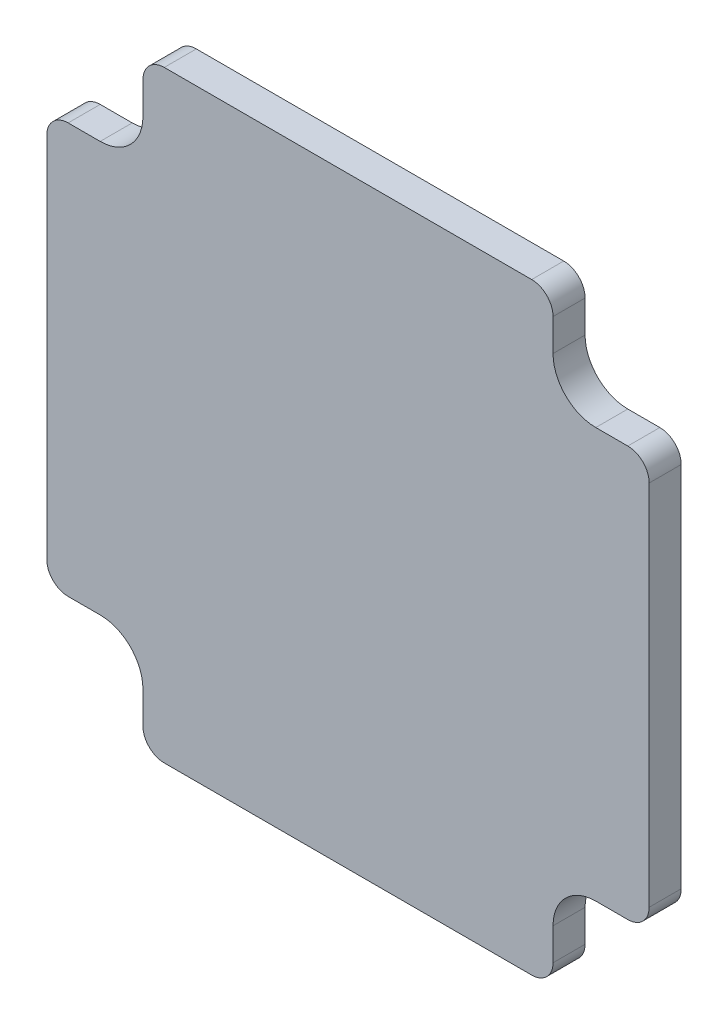
ISO-10303-21;
HEADER;
FILE_DESCRIPTION(('STEP AP214'),'2;1');
FILE_NAME('part.step','',(''),(''),'','','');
FILE_SCHEMA(('AUTOMOTIVE_DESIGN { 1 0 10303 214 1 1 1 1 }'));
ENDSEC;
DATA;
#1=APPLICATION_CONTEXT('core data for automotive mechanical design processes');
#2=APPLICATION_PROTOCOL_DEFINITION('international standard','automotive_design',2000,#1);
#3=PRODUCT_CONTEXT('',#1,'mechanical');
#4=PRODUCT('Part','Part','',(#3));
#5=PRODUCT_RELATED_PRODUCT_CATEGORY('part','',(#4));
#6=PRODUCT_DEFINITION_FORMATION('','',#4);
#7=PRODUCT_DEFINITION_CONTEXT('part definition',#1,'design');
#8=PRODUCT_DEFINITION('design','',#6,#7);
#9=PRODUCT_DEFINITION_SHAPE('','',#8);
#10=(LENGTH_UNIT() NAMED_UNIT(*) SI_UNIT(.MILLI.,.METRE.));
#11=(NAMED_UNIT(*) PLANE_ANGLE_UNIT() SI_UNIT($,.RADIAN.));
#12=(NAMED_UNIT(*) SI_UNIT($,.STERADIAN.) SOLID_ANGLE_UNIT());
#13=UNCERTAINTY_MEASURE_WITH_UNIT(LENGTH_MEASURE(1.E-05),#10,'distance_accuracy_value','');
#14=(GEOMETRIC_REPRESENTATION_CONTEXT(3) GLOBAL_UNCERTAINTY_ASSIGNED_CONTEXT((#13)) GLOBAL_UNIT_ASSIGNED_CONTEXT((#10,
#11,#12)) REPRESENTATION_CONTEXT('',''));
#15=CARTESIAN_POINT('',(0.,0.,0.));
#16=DIRECTION('',(0.,0.,1.));
#17=DIRECTION('',(1.,0.,0.));
#18=AXIS2_PLACEMENT_3D('',#15,#16,#17);
#19=CARTESIAN_POINT('',(-23.1999999999999,-23.2000000000001,3.));
#20=DIRECTION('',(0.,0.,-1.));
#21=DIRECTION('',(-1.,0.,0.));
#22=AXIS2_PLACEMENT_3D('',#19,#20,#21);
#23=CYLINDRICAL_SURFACE('',#22,4.);
#24=CARTESIAN_POINT('',(-23.1999999999999,-23.2000000000001,0.));
#25=DIRECTION('',(0.,0.,-1.));
#26=DIRECTION('',(1.,0.,0.));
#27=AXIS2_PLACEMENT_3D('',#24,#25,#26);
#28=CIRCLE('',#27,4.);
#29=CARTESIAN_POINT('',(-23.1999999999999,-19.2000000000001,0.));
#30=VERTEX_POINT('',#29);
#31=CARTESIAN_POINT('',(-19.1999999999999,-23.2000000000001,0.));
#32=VERTEX_POINT('',#31);
#33=EDGE_CURVE('E225',#30,#32,#28,.T.);
#34=ORIENTED_EDGE('',*,*,#33,.T.);
#35=DIRECTION('',(0.,0.,-1.));
#36=VECTOR('',#35,1.);
#37=CARTESIAN_POINT('',(-19.1999999999999,-23.2000000000001,3.));
#38=LINE('',#37,#36);
#39=CARTESIAN_POINT('',(-19.1999999999999,-23.2000000000001,3.));
#40=VERTEX_POINT('',#39);
#41=EDGE_CURVE('E11',#40,#32,#38,.T.);
#42=ORIENTED_EDGE('',*,*,#41,.F.);
#43=CARTESIAN_POINT('',(-23.1999999999999,-23.2000000000001,3.));
#44=DIRECTION('',(0.,0.,-1.));
#45=DIRECTION('',(1.,0.,0.));
#46=AXIS2_PLACEMENT_3D('',#43,#44,#45);
#47=CIRCLE('',#46,4.);
#48=CARTESIAN_POINT('',(-23.1999999999999,-19.2000000000001,3.));
#49=VERTEX_POINT('',#48);
#50=EDGE_CURVE('E271',#49,#40,#47,.T.);
#51=ORIENTED_EDGE('',*,*,#50,.F.);
#52=DIRECTION('',(0.,0.,-1.));
#53=VECTOR('',#52,1.);
#54=CARTESIAN_POINT('',(-23.1999999999999,-19.2000000000001,3.));
#55=LINE('',#54,#53);
#56=EDGE_CURVE('E221',#49,#30,#55,.T.);
#57=ORIENTED_EDGE('',*,*,#56,.T.);
#58=EDGE_LOOP('',(#34,#42,#51,#57));
#59=FACE_BOUND('',#58,.T.);
#60=ADVANCED_FACE('F33',(#59),#23,.F.);
#61=CARTESIAN_POINT('',(-19.1999999999999,-26.2000000000001,3.));
#62=DIRECTION('',(1.,0.,0.));
#63=DIRECTION('',(0.,0.,-1.));
#64=AXIS2_PLACEMENT_3D('',#61,#62,#63);
#65=PLANE('',#64);
#66=DIRECTION('',(0.,-1.,0.));
#67=VECTOR('',#66,1.);
#68=CARTESIAN_POINT('',(-19.1999999999999,-26.2000000000001,0.));
#69=LINE('',#68,#67);
#70=CARTESIAN_POINT('',(-19.1999999999999,-26.2000000000001,0.));
#71=VERTEX_POINT('',#70);
#72=EDGE_CURVE('E228',#32,#71,#69,.T.);
#73=ORIENTED_EDGE('',*,*,#72,.T.);
#74=DIRECTION('',(0.,0.,-1.));
#75=VECTOR('',#74,1.);
#76=CARTESIAN_POINT('',(-19.1999999999999,-26.2000000000001,3.));
#77=LINE('',#76,#75);
#78=CARTESIAN_POINT('',(-19.1999999999999,-26.2000000000001,3.));
#79=VERTEX_POINT('',#78);
#80=EDGE_CURVE('E41',#79,#71,#77,.T.);
#81=ORIENTED_EDGE('',*,*,#80,.F.);
#82=DIRECTION('',(0.,-1.,0.));
#83=VECTOR('',#82,1.);
#84=CARTESIAN_POINT('',(-19.1999999999999,-26.2000000000001,3.));
#85=LINE('',#84,#83);
#86=EDGE_CURVE('E140',#40,#79,#85,.T.);
#87=ORIENTED_EDGE('',*,*,#86,.F.);
#88=ORIENTED_EDGE('',*,*,#41,.T.);
#89=EDGE_LOOP('',(#73,#81,#87,#88));
#90=FACE_BOUND('',#89,.T.);
#91=ADVANCED_FACE('F409',(#90),#65,.F.);
#92=CARTESIAN_POINT('',(-17.1999999999999,-26.2000000000001,3.));
#93=DIRECTION('',(0.,0.,-1.));
#94=DIRECTION('',(-1.,0.,0.));
#95=AXIS2_PLACEMENT_3D('',#92,#93,#94);
#96=CYLINDRICAL_SURFACE('',#95,2.);
#97=CARTESIAN_POINT('',(-17.1999999999999,-26.2000000000001,0.));
#98=DIRECTION('',(0.,0.,1.));
#99=DIRECTION('',(1.,0.,0.));
#100=AXIS2_PLACEMENT_3D('',#97,#98,#99);
#101=CIRCLE('',#100,2.);
#102=CARTESIAN_POINT('',(-17.1999999999999,-28.2000000000001,0.));
#103=VERTEX_POINT('',#102);
#104=EDGE_CURVE('E230',#71,#103,#101,.T.);
#105=ORIENTED_EDGE('',*,*,#104,.T.);
#106=DIRECTION('',(0.,0.,-1.));
#107=VECTOR('',#106,1.);
#108=CARTESIAN_POINT('',(-17.1999999999999,-28.2000000000001,3.));
#109=LINE('',#108,#107);
#110=CARTESIAN_POINT('',(-17.1999999999999,-28.2000000000001,3.));
#111=VERTEX_POINT('',#110);
#112=EDGE_CURVE('E326',#111,#103,#109,.T.);
#113=ORIENTED_EDGE('',*,*,#112,.F.);
#114=CARTESIAN_POINT('',(-17.1999999999999,-26.2000000000001,3.));
#115=DIRECTION('',(0.,0.,1.));
#116=DIRECTION('',(1.,0.,0.));
#117=AXIS2_PLACEMENT_3D('',#114,#115,#116);
#118=CIRCLE('',#117,2.);
#119=EDGE_CURVE('E334',#79,#111,#118,.T.);
#120=ORIENTED_EDGE('',*,*,#119,.F.);
#121=ORIENTED_EDGE('',*,*,#80,.T.);
#122=EDGE_LOOP('',(#105,#113,#120,#121));
#123=FACE_BOUND('',#122,.T.);
#124=ADVANCED_FACE('F332',(#123),#96,.T.);
#125=CARTESIAN_POINT('',(-17.1999999999999,-28.2000000000001,3.));
#126=DIRECTION('',(0.,1.,0.));
#127=DIRECTION('',(0.,0.,1.));
#128=AXIS2_PLACEMENT_3D('',#125,#126,#127);
#129=PLANE('',#128);
#130=DIRECTION('',(1.,0.,0.));
#131=VECTOR('',#130,1.);
#132=CARTESIAN_POINT('',(-17.1999999999999,-28.2000000000001,0.));
#133=LINE('',#132,#131);
#134=CARTESIAN_POINT('',(17.2000000000001,-28.2000000000001,0.));
#135=VERTEX_POINT('',#134);
#136=EDGE_CURVE('E232',#103,#135,#133,.T.);
#137=ORIENTED_EDGE('',*,*,#136,.T.);
#138=DIRECTION('',(0.,0.,-1.));
#139=VECTOR('',#138,1.);
#140=CARTESIAN_POINT('',(17.2000000000001,-28.2000000000001,3.));
#141=LINE('',#140,#139);
#142=CARTESIAN_POINT('',(17.2000000000001,-28.2000000000001,3.));
#143=VERTEX_POINT('',#142);
#144=EDGE_CURVE('E323',#143,#135,#141,.T.);
#145=ORIENTED_EDGE('',*,*,#144,.F.);
#146=DIRECTION('',(1.,0.,0.));
#147=VECTOR('',#146,1.);
#148=CARTESIAN_POINT('',(-17.1999999999999,-28.2000000000001,3.));
#149=LINE('',#148,#147);
#150=EDGE_CURVE('E352',#111,#143,#149,.T.);
#151=ORIENTED_EDGE('',*,*,#150,.F.);
#152=ORIENTED_EDGE('',*,*,#112,.T.);
#153=EDGE_LOOP('',(#137,#145,#151,#152));
#154=FACE_BOUND('',#153,.T.);
#155=ADVANCED_FACE('F343',(#154),#129,.F.);
#156=CARTESIAN_POINT('',(17.2000000000001,-26.2000000000001,3.));
#157=DIRECTION('',(0.,0.,-1.));
#158=DIRECTION('',(-1.,0.,0.));
#159=AXIS2_PLACEMENT_3D('',#156,#157,#158);
#160=CYLINDRICAL_SURFACE('',#159,2.);
#161=CARTESIAN_POINT('',(17.2000000000001,-26.2000000000001,0.));
#162=DIRECTION('',(0.,0.,1.));
#163=DIRECTION('',(1.,0.,0.));
#164=AXIS2_PLACEMENT_3D('',#161,#162,#163);
#165=CIRCLE('',#164,2.);
#166=CARTESIAN_POINT('',(19.2000000000001,-26.2000000000001,0.));
#167=VERTEX_POINT('',#166);
#168=EDGE_CURVE('E234',#135,#167,#165,.T.);
#169=ORIENTED_EDGE('',*,*,#168,.T.);
#170=DIRECTION('',(0.,0.,-1.));
#171=VECTOR('',#170,1.);
#172=CARTESIAN_POINT('',(19.2000000000001,-26.2000000000001,3.));
#173=LINE('',#172,#171);
#174=CARTESIAN_POINT('',(19.2000000000001,-26.2000000000001,3.));
#175=VERTEX_POINT('',#174);
#176=EDGE_CURVE('E320',#175,#167,#173,.T.);
#177=ORIENTED_EDGE('',*,*,#176,.F.);
#178=CARTESIAN_POINT('',(17.2000000000001,-26.2000000000001,3.));
#179=DIRECTION('',(0.,0.,1.));
#180=DIRECTION('',(1.,0.,0.));
#181=AXIS2_PLACEMENT_3D('',#178,#179,#180);
#182=CIRCLE('',#181,2.);
#183=EDGE_CURVE('E349',#143,#175,#182,.T.);
#184=ORIENTED_EDGE('',*,*,#183,.F.);
#185=ORIENTED_EDGE('',*,*,#144,.T.);
#186=EDGE_LOOP('',(#169,#177,#184,#185));
#187=FACE_BOUND('',#186,.T.);
#188=ADVANCED_FACE('F347',(#187),#160,.T.);
#189=CARTESIAN_POINT('',(19.2000000000001,-26.2000000000001,3.));
#190=DIRECTION('',(-1.,0.,0.));
#191=DIRECTION('',(0.,0.,1.));
#192=AXIS2_PLACEMENT_3D('',#189,#190,#191);
#193=PLANE('',#192);
#194=DIRECTION('',(0.,1.,0.));
#195=VECTOR('',#194,1.);
#196=CARTESIAN_POINT('',(19.2000000000001,-26.2000000000001,0.));
#197=LINE('',#196,#195);
#198=CARTESIAN_POINT('',(19.2000000000001,-23.2000000000001,0.));
#199=VERTEX_POINT('',#198);
#200=EDGE_CURVE('E236',#167,#199,#197,.T.);
#201=ORIENTED_EDGE('',*,*,#200,.T.);
#202=DIRECTION('',(0.,0.,-1.));
#203=VECTOR('',#202,1.);
#204=CARTESIAN_POINT('',(19.2000000000001,-23.2000000000001,3.));
#205=LINE('',#204,#203);
#206=CARTESIAN_POINT('',(19.2000000000001,-23.2000000000001,3.));
#207=VERTEX_POINT('',#206);
#208=EDGE_CURVE('E317',#207,#199,#205,.T.);
#209=ORIENTED_EDGE('',*,*,#208,.F.);
#210=DIRECTION('',(0.,1.,0.));
#211=VECTOR('',#210,1.);
#212=CARTESIAN_POINT('',(19.2000000000001,-26.2000000000001,3.));
#213=LINE('',#212,#211);
#214=EDGE_CURVE('E351',#175,#207,#213,.T.);
#215=ORIENTED_EDGE('',*,*,#214,.F.);
#216=ORIENTED_EDGE('',*,*,#176,.T.);
#217=EDGE_LOOP('',(#201,#209,#215,#216));
#218=FACE_BOUND('',#217,.T.);
#219=ADVANCED_FACE('F422',(#218),#193,.F.);
#220=CARTESIAN_POINT('',(23.2000000000001,-23.2000000000001,3.));
#221=DIRECTION('',(0.,0.,-1.));
#222=DIRECTION('',(-1.,0.,0.));
#223=AXIS2_PLACEMENT_3D('',#220,#221,#222);
#224=CYLINDRICAL_SURFACE('',#223,4.);
#225=CARTESIAN_POINT('',(23.2000000000001,-23.2000000000001,0.));
#226=DIRECTION('',(0.,0.,-1.));
#227=DIRECTION('',(1.,0.,0.));
#228=AXIS2_PLACEMENT_3D('',#225,#226,#227);
#229=CIRCLE('',#228,4.);
#230=CARTESIAN_POINT('',(23.2000000000001,-19.2000000000001,0.));
#231=VERTEX_POINT('',#230);
#232=EDGE_CURVE('E238',#199,#231,#229,.T.);
#233=ORIENTED_EDGE('',*,*,#232,.T.);
#234=DIRECTION('',(0.,0.,-1.));
#235=VECTOR('',#234,1.);
#236=CARTESIAN_POINT('',(23.2000000000001,-19.2000000000001,3.));
#237=LINE('',#236,#235);
#238=CARTESIAN_POINT('',(23.2000000000001,-19.2000000000001,3.));
#239=VERTEX_POINT('',#238);
#240=EDGE_CURVE('E314',#239,#231,#237,.T.);
#241=ORIENTED_EDGE('',*,*,#240,.F.);
#242=CARTESIAN_POINT('',(23.2000000000001,-23.2000000000001,3.));
#243=DIRECTION('',(0.,0.,-1.));
#244=DIRECTION('',(1.,0.,0.));
#245=AXIS2_PLACEMENT_3D('',#242,#243,#244);
#246=CIRCLE('',#245,4.);
#247=EDGE_CURVE('E354',#207,#239,#246,.T.);
#248=ORIENTED_EDGE('',*,*,#247,.F.);
#249=ORIENTED_EDGE('',*,*,#208,.T.);
#250=EDGE_LOOP('',(#233,#241,#248,#249));
#251=FACE_BOUND('',#250,.T.);
#252=ADVANCED_FACE('F425',(#251),#224,.F.);
#253=CARTESIAN_POINT('',(23.2000000000001,-19.2000000000001,3.));
#254=DIRECTION('',(0.,1.,0.));
#255=DIRECTION('',(0.,0.,1.));
#256=AXIS2_PLACEMENT_3D('',#253,#254,#255);
#257=PLANE('',#256);
#258=DIRECTION('',(1.,0.,0.));
#259=VECTOR('',#258,1.);
#260=CARTESIAN_POINT('',(23.2000000000001,-19.2000000000001,0.));
#261=LINE('',#260,#259);
#262=CARTESIAN_POINT('',(26.2000000000001,-19.2000000000001,0.));
#263=VERTEX_POINT('',#262);
#264=EDGE_CURVE('E240',#231,#263,#261,.T.);
#265=ORIENTED_EDGE('',*,*,#264,.T.);
#266=DIRECTION('',(0.,0.,-1.));
#267=VECTOR('',#266,1.);
#268=CARTESIAN_POINT('',(26.2000000000001,-19.2000000000001,3.));
#269=LINE('',#268,#267);
#270=CARTESIAN_POINT('',(26.2000000000001,-19.2000000000001,3.));
#271=VERTEX_POINT('',#270);
#272=EDGE_CURVE('E311',#271,#263,#269,.T.);
#273=ORIENTED_EDGE('',*,*,#272,.F.);
#274=DIRECTION('',(1.,0.,0.));
#275=VECTOR('',#274,1.);
#276=CARTESIAN_POINT('',(23.2000000000001,-19.2000000000001,3.));
#277=LINE('',#276,#275);
#278=EDGE_CURVE('E360',#239,#271,#277,.T.);
#279=ORIENTED_EDGE('',*,*,#278,.F.);
#280=ORIENTED_EDGE('',*,*,#240,.T.);
#281=EDGE_LOOP('',(#265,#273,#279,#280));
#282=FACE_BOUND('',#281,.T.);
#283=ADVANCED_FACE('F429',(#282),#257,.F.);
#284=CARTESIAN_POINT('',(26.2000000000001,-17.2000000000001,3.));
#285=DIRECTION('',(0.,0.,-1.));
#286=DIRECTION('',(-1.,0.,0.));
#287=AXIS2_PLACEMENT_3D('',#284,#285,#286);
#288=CYLINDRICAL_SURFACE('',#287,2.);
#289=CARTESIAN_POINT('',(26.2000000000001,-17.2000000000001,0.));
#290=DIRECTION('',(0.,0.,1.));
#291=DIRECTION('',(1.,0.,0.));
#292=AXIS2_PLACEMENT_3D('',#289,#290,#291);
#293=CIRCLE('',#292,2.);
#294=CARTESIAN_POINT('',(28.2000000000001,-17.2000000000001,0.));
#295=VERTEX_POINT('',#294);
#296=EDGE_CURVE('E242',#263,#295,#293,.T.);
#297=ORIENTED_EDGE('',*,*,#296,.T.);
#298=DIRECTION('',(0.,0.,-1.));
#299=VECTOR('',#298,1.);
#300=CARTESIAN_POINT('',(28.2000000000001,-17.2000000000001,3.));
#301=LINE('',#300,#299);
#302=CARTESIAN_POINT('',(28.2000000000001,-17.2000000000001,3.));
#303=VERTEX_POINT('',#302);
#304=EDGE_CURVE('E308',#303,#295,#301,.T.);
#305=ORIENTED_EDGE('',*,*,#304,.F.);
#306=CARTESIAN_POINT('',(26.2000000000001,-17.2000000000001,3.));
#307=DIRECTION('',(0.,0.,1.));
#308=DIRECTION('',(1.,0.,0.));
#309=AXIS2_PLACEMENT_3D('',#306,#307,#308);
#310=CIRCLE('',#309,2.);
#311=EDGE_CURVE('E362',#271,#303,#310,.T.);
#312=ORIENTED_EDGE('',*,*,#311,.F.);
#313=ORIENTED_EDGE('',*,*,#272,.T.);
#314=EDGE_LOOP('',(#297,#305,#312,#313));
#315=FACE_BOUND('',#314,.T.);
#316=ADVANCED_FACE('F433',(#315),#288,.T.);
#317=CARTESIAN_POINT('',(28.2000000000001,-17.2000000000001,3.));
#318=DIRECTION('',(-1.,0.,0.));
#319=DIRECTION('',(0.,0.,1.));
#320=AXIS2_PLACEMENT_3D('',#317,#318,#319);
#321=PLANE('',#320);
#322=DIRECTION('',(0.,1.,0.));
#323=VECTOR('',#322,1.);
#324=CARTESIAN_POINT('',(28.2000000000001,-17.2000000000001,0.));
#325=LINE('',#324,#323);
#326=CARTESIAN_POINT('',(28.2000000000001,17.1999999999999,0.));
#327=VERTEX_POINT('',#326);
#328=EDGE_CURVE('E244',#295,#327,#325,.T.);
#329=ORIENTED_EDGE('',*,*,#328,.T.);
#330=DIRECTION('',(0.,0.,-1.));
#331=VECTOR('',#330,1.);
#332=CARTESIAN_POINT('',(28.2000000000001,17.1999999999999,3.));
#333=LINE('',#332,#331);
#334=CARTESIAN_POINT('',(28.2000000000001,17.1999999999999,3.));
#335=VERTEX_POINT('',#334);
#336=EDGE_CURVE('E305',#335,#327,#333,.T.);
#337=ORIENTED_EDGE('',*,*,#336,.F.);
#338=DIRECTION('',(0.,1.,0.));
#339=VECTOR('',#338,1.);
#340=CARTESIAN_POINT('',(28.2000000000001,-17.2000000000001,3.));
#341=LINE('',#340,#339);
#342=EDGE_CURVE('E364',#303,#335,#341,.T.);
#343=ORIENTED_EDGE('',*,*,#342,.F.);
#344=ORIENTED_EDGE('',*,*,#304,.T.);
#345=EDGE_LOOP('',(#329,#337,#343,#344));
#346=FACE_BOUND('',#345,.T.);
#347=ADVANCED_FACE('F437',(#346),#321,.F.);
#348=CARTESIAN_POINT('',(26.2000000000001,17.1999999999999,3.));
#349=DIRECTION('',(0.,0.,-1.));
#350=DIRECTION('',(-1.,0.,0.));
#351=AXIS2_PLACEMENT_3D('',#348,#349,#350);
#352=CYLINDRICAL_SURFACE('',#351,2.);
#353=CARTESIAN_POINT('',(26.2000000000001,17.1999999999999,0.));
#354=DIRECTION('',(0.,0.,1.));
#355=DIRECTION('',(1.,0.,0.));
#356=AXIS2_PLACEMENT_3D('',#353,#354,#355);
#357=CIRCLE('',#356,2.);
#358=CARTESIAN_POINT('',(26.2000000000001,19.1999999999999,0.));
#359=VERTEX_POINT('',#358);
#360=EDGE_CURVE('E246',#327,#359,#357,.T.);
#361=ORIENTED_EDGE('',*,*,#360,.T.);
#362=DIRECTION('',(0.,0.,-1.));
#363=VECTOR('',#362,1.);
#364=CARTESIAN_POINT('',(26.2000000000001,19.1999999999999,3.));
#365=LINE('',#364,#363);
#366=CARTESIAN_POINT('',(26.2000000000001,19.1999999999999,3.));
#367=VERTEX_POINT('',#366);
#368=EDGE_CURVE('E302',#367,#359,#365,.T.);
#369=ORIENTED_EDGE('',*,*,#368,.F.);
#370=CARTESIAN_POINT('',(26.2000000000001,17.1999999999999,3.));
#371=DIRECTION('',(0.,0.,1.));
#372=DIRECTION('',(1.,0.,0.));
#373=AXIS2_PLACEMENT_3D('',#370,#371,#372);
#374=CIRCLE('',#373,2.);
#375=EDGE_CURVE('E366',#335,#367,#374,.T.);
#376=ORIENTED_EDGE('',*,*,#375,.F.);
#377=ORIENTED_EDGE('',*,*,#336,.T.);
#378=EDGE_LOOP('',(#361,#369,#376,#377));
#379=FACE_BOUND('',#378,.T.);
#380=ADVANCED_FACE('F441',(#379),#352,.T.);
#381=CARTESIAN_POINT('',(23.2000000000001,19.1999999999999,3.));
#382=DIRECTION('',(0.,-1.,0.));
#383=DIRECTION('',(0.,0.,-1.));
#384=AXIS2_PLACEMENT_3D('',#381,#382,#383);
#385=PLANE('',#384);
#386=DIRECTION('',(-1.,0.,0.));
#387=VECTOR('',#386,1.);
#388=CARTESIAN_POINT('',(23.2000000000001,19.1999999999999,0.));
#389=LINE('',#388,#387);
#390=CARTESIAN_POINT('',(23.2000000000001,19.1999999999999,0.));
#391=VERTEX_POINT('',#390);
#392=EDGE_CURVE('E248',#359,#391,#389,.T.);
#393=ORIENTED_EDGE('',*,*,#392,.T.);
#394=DIRECTION('',(0.,0.,-1.));
#395=VECTOR('',#394,1.);
#396=CARTESIAN_POINT('',(23.2000000000001,19.1999999999999,3.));
#397=LINE('',#396,#395);
#398=CARTESIAN_POINT('',(23.2000000000001,19.1999999999999,3.));
#399=VERTEX_POINT('',#398);
#400=EDGE_CURVE('E299',#399,#391,#397,.T.);
#401=ORIENTED_EDGE('',*,*,#400,.F.);
#402=DIRECTION('',(-1.,0.,0.));
#403=VECTOR('',#402,1.);
#404=CARTESIAN_POINT('',(23.2000000000001,19.1999999999999,3.));
#405=LINE('',#404,#403);
#406=EDGE_CURVE('E368',#367,#399,#405,.T.);
#407=ORIENTED_EDGE('',*,*,#406,.F.);
#408=ORIENTED_EDGE('',*,*,#368,.T.);
#409=EDGE_LOOP('',(#393,#401,#407,#408));
#410=FACE_BOUND('',#409,.T.);
#411=ADVANCED_FACE('F445',(#410),#385,.F.);
#412=CARTESIAN_POINT('',(23.2000000000001,23.1999999999999,3.));
#413=DIRECTION('',(0.,0.,-1.));
#414=DIRECTION('',(-1.,0.,0.));
#415=AXIS2_PLACEMENT_3D('',#412,#413,#414);
#416=CYLINDRICAL_SURFACE('',#415,4.);
#417=CARTESIAN_POINT('',(23.2000000000001,23.1999999999999,0.));
#418=DIRECTION('',(0.,0.,-1.));
#419=DIRECTION('',(1.,0.,0.));
#420=AXIS2_PLACEMENT_3D('',#417,#418,#419);
#421=CIRCLE('',#420,4.);
#422=CARTESIAN_POINT('',(19.2000000000001,23.1999999999999,0.));
#423=VERTEX_POINT('',#422);
#424=EDGE_CURVE('E250',#391,#423,#421,.T.);
#425=ORIENTED_EDGE('',*,*,#424,.T.);
#426=DIRECTION('',(0.,0.,-1.));
#427=VECTOR('',#426,1.);
#428=CARTESIAN_POINT('',(19.2000000000001,23.1999999999999,3.));
#429=LINE('',#428,#427);
#430=CARTESIAN_POINT('',(19.2000000000001,23.1999999999999,3.));
#431=VERTEX_POINT('',#430);
#432=EDGE_CURVE('E296',#431,#423,#429,.T.);
#433=ORIENTED_EDGE('',*,*,#432,.F.);
#434=CARTESIAN_POINT('',(23.2000000000001,23.1999999999999,3.));
#435=DIRECTION('',(0.,0.,-1.));
#436=DIRECTION('',(1.,0.,0.));
#437=AXIS2_PLACEMENT_3D('',#434,#435,#436);
#438=CIRCLE('',#437,4.);
#439=EDGE_CURVE('E370',#399,#431,#438,.T.);
#440=ORIENTED_EDGE('',*,*,#439,.F.);
#441=ORIENTED_EDGE('',*,*,#400,.T.);
#442=EDGE_LOOP('',(#425,#433,#440,#441));
#443=FACE_BOUND('',#442,.T.);
#444=ADVANCED_FACE('F449',(#443),#416,.F.);
#445=CARTESIAN_POINT('',(19.2000000000001,26.1999999999999,3.));
#446=DIRECTION('',(-1.,0.,0.));
#447=DIRECTION('',(0.,0.,1.));
#448=AXIS2_PLACEMENT_3D('',#445,#446,#447);
#449=PLANE('',#448);
#450=DIRECTION('',(0.,1.,0.));
#451=VECTOR('',#450,1.);
#452=CARTESIAN_POINT('',(19.2000000000001,26.1999999999999,0.));
#453=LINE('',#452,#451);
#454=CARTESIAN_POINT('',(19.2000000000001,26.1999999999999,0.));
#455=VERTEX_POINT('',#454);
#456=EDGE_CURVE('E252',#423,#455,#453,.T.);
#457=ORIENTED_EDGE('',*,*,#456,.T.);
#458=DIRECTION('',(0.,0.,-1.));
#459=VECTOR('',#458,1.);
#460=CARTESIAN_POINT('',(19.2000000000001,26.1999999999999,3.));
#461=LINE('',#460,#459);
#462=CARTESIAN_POINT('',(19.2000000000001,26.1999999999999,3.));
#463=VERTEX_POINT('',#462);
#464=EDGE_CURVE('E293',#463,#455,#461,.T.);
#465=ORIENTED_EDGE('',*,*,#464,.F.);
#466=DIRECTION('',(0.,1.,0.));
#467=VECTOR('',#466,1.);
#468=CARTESIAN_POINT('',(19.2000000000001,26.1999999999999,3.));
#469=LINE('',#468,#467);
#470=EDGE_CURVE('E372',#431,#463,#469,.T.);
#471=ORIENTED_EDGE('',*,*,#470,.F.);
#472=ORIENTED_EDGE('',*,*,#432,.T.);
#473=EDGE_LOOP('',(#457,#465,#471,#472));
#474=FACE_BOUND('',#473,.T.);
#475=ADVANCED_FACE('F453',(#474),#449,.F.);
#476=CARTESIAN_POINT('',(17.2000000000001,26.1999999999999,3.));
#477=DIRECTION('',(0.,0.,-1.));
#478=DIRECTION('',(-1.,0.,0.));
#479=AXIS2_PLACEMENT_3D('',#476,#477,#478);
#480=CYLINDRICAL_SURFACE('',#479,2.);
#481=CARTESIAN_POINT('',(17.2000000000001,26.1999999999999,0.));
#482=DIRECTION('',(0.,0.,1.));
#483=DIRECTION('',(1.,0.,0.));
#484=AXIS2_PLACEMENT_3D('',#481,#482,#483);
#485=CIRCLE('',#484,2.);
#486=CARTESIAN_POINT('',(17.2000000000001,28.1999999999999,0.));
#487=VERTEX_POINT('',#486);
#488=EDGE_CURVE('E254',#455,#487,#485,.T.);
#489=ORIENTED_EDGE('',*,*,#488,.T.);
#490=DIRECTION('',(0.,0.,-1.));
#491=VECTOR('',#490,1.);
#492=CARTESIAN_POINT('',(17.2000000000001,28.1999999999999,3.));
#493=LINE('',#492,#491);
#494=CARTESIAN_POINT('',(17.2000000000001,28.1999999999999,3.));
#495=VERTEX_POINT('',#494);
#496=EDGE_CURVE('E290',#495,#487,#493,.T.);
#497=ORIENTED_EDGE('',*,*,#496,.F.);
#498=CARTESIAN_POINT('',(17.2000000000001,26.1999999999999,3.));
#499=DIRECTION('',(0.,0.,1.));
#500=DIRECTION('',(1.,0.,0.));
#501=AXIS2_PLACEMENT_3D('',#498,#499,#500);
#502=CIRCLE('',#501,2.);
#503=EDGE_CURVE('E374',#463,#495,#502,.T.);
#504=ORIENTED_EDGE('',*,*,#503,.F.);
#505=ORIENTED_EDGE('',*,*,#464,.T.);
#506=EDGE_LOOP('',(#489,#497,#504,#505));
#507=FACE_BOUND('',#506,.T.);
#508=ADVANCED_FACE('F457',(#507),#480,.T.);
#509=CARTESIAN_POINT('',(17.2000000000001,28.1999999999999,3.));
#510=DIRECTION('',(0.,-1.,0.));
#511=DIRECTION('',(0.,0.,-1.));
#512=AXIS2_PLACEMENT_3D('',#509,#510,#511);
#513=PLANE('',#512);
#514=DIRECTION('',(-1.,0.,0.));
#515=VECTOR('',#514,1.);
#516=CARTESIAN_POINT('',(17.2000000000001,28.1999999999999,0.));
#517=LINE('',#516,#515);
#518=CARTESIAN_POINT('',(-17.1999999999999,28.1999999999999,0.));
#519=VERTEX_POINT('',#518);
#520=EDGE_CURVE('E256',#487,#519,#517,.T.);
#521=ORIENTED_EDGE('',*,*,#520,.T.);
#522=DIRECTION('',(0.,0.,-1.));
#523=VECTOR('',#522,1.);
#524=CARTESIAN_POINT('',(-17.1999999999999,28.1999999999999,3.));
#525=LINE('',#524,#523);
#526=CARTESIAN_POINT('',(-17.1999999999999,28.1999999999999,3.));
#527=VERTEX_POINT('',#526);
#528=EDGE_CURVE('E287',#527,#519,#525,.T.);
#529=ORIENTED_EDGE('',*,*,#528,.F.);
#530=DIRECTION('',(-1.,0.,0.));
#531=VECTOR('',#530,1.);
#532=CARTESIAN_POINT('',(17.2000000000001,28.1999999999999,3.));
#533=LINE('',#532,#531);
#534=EDGE_CURVE('E376',#495,#527,#533,.T.);
#535=ORIENTED_EDGE('',*,*,#534,.F.);
#536=ORIENTED_EDGE('',*,*,#496,.T.);
#537=EDGE_LOOP('',(#521,#529,#535,#536));
#538=FACE_BOUND('',#537,.T.);
#539=ADVANCED_FACE('F461',(#538),#513,.F.);
#540=CARTESIAN_POINT('',(-17.1999999999999,26.1999999999999,3.));
#541=DIRECTION('',(0.,0.,-1.));
#542=DIRECTION('',(-1.,0.,0.));
#543=AXIS2_PLACEMENT_3D('',#540,#541,#542);
#544=CYLINDRICAL_SURFACE('',#543,2.);
#545=CARTESIAN_POINT('',(-17.1999999999999,26.1999999999999,0.));
#546=DIRECTION('',(0.,0.,1.));
#547=DIRECTION('',(1.,0.,0.));
#548=AXIS2_PLACEMENT_3D('',#545,#546,#547);
#549=CIRCLE('',#548,2.);
#550=CARTESIAN_POINT('',(-19.1999999999999,26.1999999999999,0.));
#551=VERTEX_POINT('',#550);
#552=EDGE_CURVE('E258',#519,#551,#549,.T.);
#553=ORIENTED_EDGE('',*,*,#552,.T.);
#554=DIRECTION('',(0.,0.,-1.));
#555=VECTOR('',#554,1.);
#556=CARTESIAN_POINT('',(-19.1999999999999,26.1999999999999,3.));
#557=LINE('',#556,#555);
#558=CARTESIAN_POINT('',(-19.1999999999999,26.1999999999999,3.));
#559=VERTEX_POINT('',#558);
#560=EDGE_CURVE('E284',#559,#551,#557,.T.);
#561=ORIENTED_EDGE('',*,*,#560,.F.);
#562=CARTESIAN_POINT('',(-17.1999999999999,26.1999999999999,3.));
#563=DIRECTION('',(0.,0.,1.));
#564=DIRECTION('',(1.,0.,0.));
#565=AXIS2_PLACEMENT_3D('',#562,#563,#564);
#566=CIRCLE('',#565,2.);
#567=EDGE_CURVE('E378',#527,#559,#566,.T.);
#568=ORIENTED_EDGE('',*,*,#567,.F.);
#569=ORIENTED_EDGE('',*,*,#528,.T.);
#570=EDGE_LOOP('',(#553,#561,#568,#569));
#571=FACE_BOUND('',#570,.T.);
#572=ADVANCED_FACE('F465',(#571),#544,.T.);
#573=CARTESIAN_POINT('',(-19.1999999999999,26.1999999999999,3.));
#574=DIRECTION('',(1.,0.,0.));
#575=DIRECTION('',(0.,0.,-1.));
#576=AXIS2_PLACEMENT_3D('',#573,#574,#575);
#577=PLANE('',#576);
#578=DIRECTION('',(0.,-1.,0.));
#579=VECTOR('',#578,1.);
#580=CARTESIAN_POINT('',(-19.1999999999999,26.1999999999999,0.));
#581=LINE('',#580,#579);
#582=CARTESIAN_POINT('',(-19.1999999999999,23.1999999999999,0.));
#583=VERTEX_POINT('',#582);
#584=EDGE_CURVE('E260',#551,#583,#581,.T.);
#585=ORIENTED_EDGE('',*,*,#584,.T.);
#586=DIRECTION('',(0.,0.,-1.));
#587=VECTOR('',#586,1.);
#588=CARTESIAN_POINT('',(-19.1999999999999,23.1999999999999,3.));
#589=LINE('',#588,#587);
#590=CARTESIAN_POINT('',(-19.1999999999999,23.1999999999999,3.));
#591=VERTEX_POINT('',#590);
#592=EDGE_CURVE('E281',#591,#583,#589,.T.);
#593=ORIENTED_EDGE('',*,*,#592,.F.);
#594=DIRECTION('',(0.,-1.,0.));
#595=VECTOR('',#594,1.);
#596=CARTESIAN_POINT('',(-19.1999999999999,26.1999999999999,3.));
#597=LINE('',#596,#595);
#598=EDGE_CURVE('E380',#559,#591,#597,.T.);
#599=ORIENTED_EDGE('',*,*,#598,.F.);
#600=ORIENTED_EDGE('',*,*,#560,.T.);
#601=EDGE_LOOP('',(#585,#593,#599,#600));
#602=FACE_BOUND('',#601,.T.);
#603=ADVANCED_FACE('F469',(#602),#577,.F.);
#604=CARTESIAN_POINT('',(-23.1999999999999,23.1999999999999,3.));
#605=DIRECTION('',(0.,0.,-1.));
#606=DIRECTION('',(-1.,0.,0.));
#607=AXIS2_PLACEMENT_3D('',#604,#605,#606);
#608=CYLINDRICAL_SURFACE('',#607,4.);
#609=CARTESIAN_POINT('',(-23.1999999999999,23.1999999999999,0.));
#610=DIRECTION('',(0.,0.,-1.));
#611=DIRECTION('',(1.,0.,0.));
#612=AXIS2_PLACEMENT_3D('',#609,#610,#611);
#613=CIRCLE('',#612,4.);
#614=CARTESIAN_POINT('',(-23.1999999999999,19.1999999999999,0.));
#615=VERTEX_POINT('',#614);
#616=EDGE_CURVE('E262',#583,#615,#613,.T.);
#617=ORIENTED_EDGE('',*,*,#616,.T.);
#618=DIRECTION('',(0.,0.,-1.));
#619=VECTOR('',#618,1.);
#620=CARTESIAN_POINT('',(-23.1999999999999,19.1999999999999,3.));
#621=LINE('',#620,#619);
#622=CARTESIAN_POINT('',(-23.1999999999999,19.1999999999999,3.));
#623=VERTEX_POINT('',#622);
#624=EDGE_CURVE('E278',#623,#615,#621,.T.);
#625=ORIENTED_EDGE('',*,*,#624,.F.);
#626=CARTESIAN_POINT('',(-23.1999999999999,23.1999999999999,3.));
#627=DIRECTION('',(0.,0.,-1.));
#628=DIRECTION('',(1.,0.,0.));
#629=AXIS2_PLACEMENT_3D('',#626,#627,#628);
#630=CIRCLE('',#629,4.);
#631=EDGE_CURVE('E382',#591,#623,#630,.T.);
#632=ORIENTED_EDGE('',*,*,#631,.F.);
#633=ORIENTED_EDGE('',*,*,#592,.T.);
#634=EDGE_LOOP('',(#617,#625,#632,#633));
#635=FACE_BOUND('',#634,.T.);
#636=ADVANCED_FACE('F473',(#635),#608,.F.);
#637=CARTESIAN_POINT('',(-23.1999999999999,19.1999999999999,3.));
#638=DIRECTION('',(0.,-1.,0.));
#639=DIRECTION('',(0.,0.,-1.));
#640=AXIS2_PLACEMENT_3D('',#637,#638,#639);
#641=PLANE('',#640);
#642=DIRECTION('',(-1.,0.,0.));
#643=VECTOR('',#642,1.);
#644=CARTESIAN_POINT('',(-23.1999999999999,19.1999999999999,0.));
#645=LINE('',#644,#643);
#646=CARTESIAN_POINT('',(-26.1999999999999,19.1999999999999,0.));
#647=VERTEX_POINT('',#646);
#648=EDGE_CURVE('E264',#615,#647,#645,.T.);
#649=ORIENTED_EDGE('',*,*,#648,.T.);
#650=DIRECTION('',(0.,0.,-1.));
#651=VECTOR('',#650,1.);
#652=CARTESIAN_POINT('',(-26.1999999999999,19.1999999999999,3.));
#653=LINE('',#652,#651);
#654=CARTESIAN_POINT('',(-26.1999999999999,19.1999999999999,3.));
#655=VERTEX_POINT('',#654);
#656=EDGE_CURVE('E275',#655,#647,#653,.T.);
#657=ORIENTED_EDGE('',*,*,#656,.F.);
#658=DIRECTION('',(-1.,0.,0.));
#659=VECTOR('',#658,1.);
#660=CARTESIAN_POINT('',(-23.1999999999999,19.1999999999999,3.));
#661=LINE('',#660,#659);
#662=EDGE_CURVE('E384',#623,#655,#661,.T.);
#663=ORIENTED_EDGE('',*,*,#662,.F.);
#664=ORIENTED_EDGE('',*,*,#624,.T.);
#665=EDGE_LOOP('',(#649,#657,#663,#664));
#666=FACE_BOUND('',#665,.T.);
#667=ADVANCED_FACE('F390',(#666),#641,.F.);
#668=CARTESIAN_POINT('',(-26.1999999999999,17.1999999999999,3.));
#669=DIRECTION('',(0.,0.,-1.));
#670=DIRECTION('',(-1.,0.,0.));
#671=AXIS2_PLACEMENT_3D('',#668,#669,#670);
#672=CYLINDRICAL_SURFACE('',#671,2.);
#673=CARTESIAN_POINT('',(-26.1999999999999,17.1999999999999,0.));
#674=DIRECTION('',(0.,0.,1.));
#675=DIRECTION('',(1.,0.,0.));
#676=AXIS2_PLACEMENT_3D('',#673,#674,#675);
#677=CIRCLE('',#676,2.);
#678=CARTESIAN_POINT('',(-28.1999999999999,17.1999999999999,0.));
#679=VERTEX_POINT('',#678);
#680=EDGE_CURVE('E266',#647,#679,#677,.T.);
#681=ORIENTED_EDGE('',*,*,#680,.T.);
#682=DIRECTION('',(0.,0.,-1.));
#683=VECTOR('',#682,1.);
#684=CARTESIAN_POINT('',(-28.1999999999999,17.1999999999999,3.));
#685=LINE('',#684,#683);
#686=CARTESIAN_POINT('',(-28.1999999999999,17.1999999999999,3.));
#687=VERTEX_POINT('',#686);
#688=EDGE_CURVE('E216',#687,#679,#685,.T.);
#689=ORIENTED_EDGE('',*,*,#688,.F.);
#690=CARTESIAN_POINT('',(-26.1999999999999,17.1999999999999,3.));
#691=DIRECTION('',(0.,0.,1.));
#692=DIRECTION('',(1.,0.,0.));
#693=AXIS2_PLACEMENT_3D('',#690,#691,#692);
#694=CIRCLE('',#693,2.);
#695=EDGE_CURVE('E207',#655,#687,#694,.T.);
#696=ORIENTED_EDGE('',*,*,#695,.F.);
#697=ORIENTED_EDGE('',*,*,#656,.T.);
#698=EDGE_LOOP('',(#681,#689,#696,#697));
#699=FACE_BOUND('',#698,.T.);
#700=ADVANCED_FACE('F394',(#699),#672,.T.);
#701=CARTESIAN_POINT('',(-28.1999999999999,17.1999999999999,3.));
#702=DIRECTION('',(1.,0.,0.));
#703=DIRECTION('',(0.,0.,-1.));
#704=AXIS2_PLACEMENT_3D('',#701,#702,#703);
#705=PLANE('',#704);
#706=DIRECTION('',(0.,-1.,0.));
#707=VECTOR('',#706,1.);
#708=CARTESIAN_POINT('',(-28.1999999999999,17.1999999999999,0.));
#709=LINE('',#708,#707);
#710=CARTESIAN_POINT('',(-28.1999999999999,-17.2000000000001,0.));
#711=VERTEX_POINT('',#710);
#712=EDGE_CURVE('E215',#679,#711,#709,.T.);
#713=ORIENTED_EDGE('',*,*,#712,.T.);
#714=DIRECTION('',(0.,0.,-1.));
#715=VECTOR('',#714,1.);
#716=CARTESIAN_POINT('',(-28.1999999999999,-17.2000000000001,3.));
#717=LINE('',#716,#715);
#718=CARTESIAN_POINT('',(-28.1999999999999,-17.2000000000001,3.));
#719=VERTEX_POINT('',#718);
#720=EDGE_CURVE('E212',#719,#711,#717,.T.);
#721=ORIENTED_EDGE('',*,*,#720,.F.);
#722=DIRECTION('',(0.,-1.,0.));
#723=VECTOR('',#722,1.);
#724=CARTESIAN_POINT('',(-28.1999999999999,17.1999999999999,3.));
#725=LINE('',#724,#723);
#726=EDGE_CURVE('E201',#687,#719,#725,.T.);
#727=ORIENTED_EDGE('',*,*,#726,.F.);
#728=ORIENTED_EDGE('',*,*,#688,.T.);
#729=EDGE_LOOP('',(#713,#721,#727,#728));
#730=FACE_BOUND('',#729,.T.);
#731=ADVANCED_FACE('F213',(#730),#705,.F.);
#732=CARTESIAN_POINT('',(-26.1999999999999,-17.2000000000001,3.));
#733=DIRECTION('',(0.,0.,-1.));
#734=DIRECTION('',(-1.,0.,0.));
#735=AXIS2_PLACEMENT_3D('',#732,#733,#734);
#736=CYLINDRICAL_SURFACE('',#735,2.);
#737=CARTESIAN_POINT('',(-26.1999999999999,-17.2000000000001,0.));
#738=DIRECTION('',(0.,0.,1.));
#739=DIRECTION('',(1.,0.,0.));
#740=AXIS2_PLACEMENT_3D('',#737,#738,#739);
#741=CIRCLE('',#740,2.);
#742=CARTESIAN_POINT('',(-26.1999999999999,-19.2000000000001,0.));
#743=VERTEX_POINT('',#742);
#744=EDGE_CURVE('E126',#711,#743,#741,.T.);
#745=ORIENTED_EDGE('',*,*,#744,.T.);
#746=DIRECTION('',(0.,0.,-1.));
#747=VECTOR('',#746,1.);
#748=CARTESIAN_POINT('',(-26.1999999999999,-19.2000000000001,3.));
#749=LINE('',#748,#747);
#750=CARTESIAN_POINT('',(-26.1999999999999,-19.2000000000001,3.));
#751=VERTEX_POINT('',#750);
#752=EDGE_CURVE('E217',#751,#743,#749,.T.);
#753=ORIENTED_EDGE('',*,*,#752,.F.);
#754=CARTESIAN_POINT('',(-26.1999999999999,-17.2000000000001,3.));
#755=DIRECTION('',(0.,0.,1.));
#756=DIRECTION('',(1.,0.,0.));
#757=AXIS2_PLACEMENT_3D('',#754,#755,#756);
#758=CIRCLE('',#757,2.);
#759=EDGE_CURVE('E205',#719,#751,#758,.T.);
#760=ORIENTED_EDGE('',*,*,#759,.F.);
#761=ORIENTED_EDGE('',*,*,#720,.T.);
#762=EDGE_LOOP('',(#745,#753,#760,#761));
#763=FACE_BOUND('',#762,.T.);
#764=ADVANCED_FACE('F219',(#763),#736,.T.);
#765=CARTESIAN_POINT('',(-23.1999999999999,-19.2000000000001,3.));
#766=DIRECTION('',(0.,1.,0.));
#767=DIRECTION('',(0.,0.,1.));
#768=AXIS2_PLACEMENT_3D('',#765,#766,#767);
#769=PLANE('',#768);
#770=DIRECTION('',(1.,0.,0.));
#771=VECTOR('',#770,1.);
#772=CARTESIAN_POINT('',(-23.1999999999999,-19.2000000000001,0.));
#773=LINE('',#772,#771);
#774=EDGE_CURVE('E132',#743,#30,#773,.T.);
#775=ORIENTED_EDGE('',*,*,#774,.T.);
#776=ORIENTED_EDGE('',*,*,#56,.F.);
#777=DIRECTION('',(1.,0.,0.));
#778=VECTOR('',#777,1.);
#779=CARTESIAN_POINT('',(-23.1999999999999,-19.2000000000001,3.));
#780=LINE('',#779,#778);
#781=EDGE_CURVE('E49',#751,#49,#780,.T.);
#782=ORIENTED_EDGE('',*,*,#781,.F.);
#783=ORIENTED_EDGE('',*,*,#752,.T.);
#784=EDGE_LOOP('',(#775,#776,#782,#783));
#785=FACE_BOUND('',#784,.T.);
#786=ADVANCED_FACE('F398',(#785),#769,.F.);
#787=CARTESIAN_POINT('',(-23.1999999999999,-23.2000000000001,3.));
#788=DIRECTION('',(0.,0.,1.));
#789=DIRECTION('',(1.,0.,0.));
#790=AXIS2_PLACEMENT_3D('',#787,#788,#789);
#791=PLANE('',#790);
#792=ORIENTED_EDGE('',*,*,#50,.T.);
#793=ORIENTED_EDGE('',*,*,#86,.T.);
#794=ORIENTED_EDGE('',*,*,#119,.T.);
#795=ORIENTED_EDGE('',*,*,#150,.T.);
#796=ORIENTED_EDGE('',*,*,#183,.T.);
#797=ORIENTED_EDGE('',*,*,#214,.T.);
#798=ORIENTED_EDGE('',*,*,#247,.T.);
#799=ORIENTED_EDGE('',*,*,#278,.T.);
#800=ORIENTED_EDGE('',*,*,#311,.T.);
#801=ORIENTED_EDGE('',*,*,#342,.T.);
#802=ORIENTED_EDGE('',*,*,#375,.T.);
#803=ORIENTED_EDGE('',*,*,#406,.T.);
#804=ORIENTED_EDGE('',*,*,#439,.T.);
#805=ORIENTED_EDGE('',*,*,#470,.T.);
#806=ORIENTED_EDGE('',*,*,#503,.T.);
#807=ORIENTED_EDGE('',*,*,#534,.T.);
#808=ORIENTED_EDGE('',*,*,#567,.T.);
#809=ORIENTED_EDGE('',*,*,#598,.T.);
#810=ORIENTED_EDGE('',*,*,#631,.T.);
#811=ORIENTED_EDGE('',*,*,#662,.T.);
#812=ORIENTED_EDGE('',*,*,#695,.T.);
#813=ORIENTED_EDGE('',*,*,#726,.T.);
#814=ORIENTED_EDGE('',*,*,#759,.T.);
#815=ORIENTED_EDGE('',*,*,#781,.T.);
#816=EDGE_LOOP('',(#792,#793,#794,#795,#796,#797,#798,#799,#800,#801,#802,#803,#804,#805,#806,
#807,#808,#809,#810,#811,#812,#813,#814,#815));
#817=FACE_BOUND('',#816,.T.);
#818=ADVANCED_FACE('F203',(#817),#791,.T.);
#819=CARTESIAN_POINT('',(-23.1999999999999,-23.2000000000001,0.));
#820=DIRECTION('',(0.,0.,1.));
#821=DIRECTION('',(1.,0.,0.));
#822=AXIS2_PLACEMENT_3D('',#819,#820,#821);
#823=PLANE('',#822);
#824=ORIENTED_EDGE('',*,*,#33,.F.);
#825=ORIENTED_EDGE('',*,*,#774,.F.);
#826=ORIENTED_EDGE('',*,*,#744,.F.);
#827=ORIENTED_EDGE('',*,*,#712,.F.);
#828=ORIENTED_EDGE('',*,*,#680,.F.);
#829=ORIENTED_EDGE('',*,*,#648,.F.);
#830=ORIENTED_EDGE('',*,*,#616,.F.);
#831=ORIENTED_EDGE('',*,*,#584,.F.);
#832=ORIENTED_EDGE('',*,*,#552,.F.);
#833=ORIENTED_EDGE('',*,*,#520,.F.);
#834=ORIENTED_EDGE('',*,*,#488,.F.);
#835=ORIENTED_EDGE('',*,*,#456,.F.);
#836=ORIENTED_EDGE('',*,*,#424,.F.);
#837=ORIENTED_EDGE('',*,*,#392,.F.);
#838=ORIENTED_EDGE('',*,*,#360,.F.);
#839=ORIENTED_EDGE('',*,*,#328,.F.);
#840=ORIENTED_EDGE('',*,*,#296,.F.);
#841=ORIENTED_EDGE('',*,*,#264,.F.);
#842=ORIENTED_EDGE('',*,*,#232,.F.);
#843=ORIENTED_EDGE('',*,*,#200,.F.);
#844=ORIENTED_EDGE('',*,*,#168,.F.);
#845=ORIENTED_EDGE('',*,*,#136,.F.);
#846=ORIENTED_EDGE('',*,*,#104,.F.);
#847=ORIENTED_EDGE('',*,*,#72,.F.);
#848=EDGE_LOOP('',(#824,#825,#826,#827,#828,#829,#830,#831,#832,#833,#834,#835,#836,#837,#838,
#839,#840,#841,#842,#843,#844,#845,#846,#847));
#849=FACE_BOUND('',#848,.T.);
#850=ADVANCED_FACE('F338',(#849),#823,.F.);
#851=CLOSED_SHELL('',(#60,#91,#124,#155,#188,#219,#252,#283,#316,#347,#380,#411,#444,#475,#508,
#539,#572,#603,#636,#667,#700,#731,#764,#786,#818,#850));
#852=MANIFOLD_SOLID_BREP('B2',#851);
#853=ADVANCED_BREP_SHAPE_REPRESENTATION('',(#18,#852),#14);
#854=SHAPE_DEFINITION_REPRESENTATION(#9,#853);
ENDSEC;
END-ISO-10303-21;
